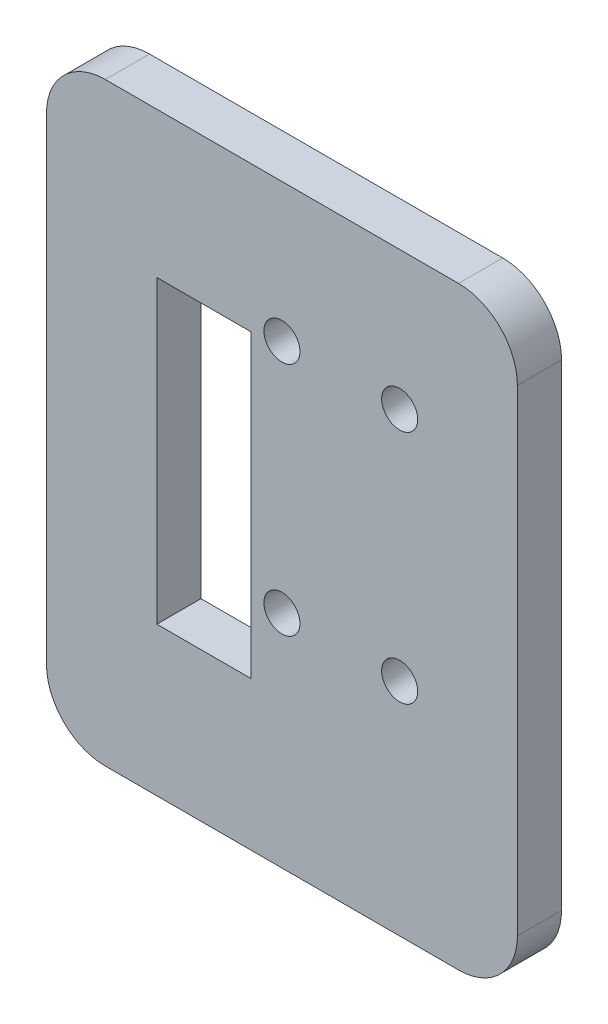
ISO-10303-21;
HEADER;
FILE_DESCRIPTION(('STEP AP214'),'2;1');
FILE_NAME('part.step','',(''),(''),'','','');
FILE_SCHEMA(('AUTOMOTIVE_DESIGN { 1 0 10303 214 1 1 1 1 }'));
ENDSEC;
DATA;
#1=APPLICATION_CONTEXT('core data for automotive mechanical design processes');
#2=APPLICATION_PROTOCOL_DEFINITION('international standard','automotive_design',2000,#1);
#3=PRODUCT_CONTEXT('',#1,'mechanical');
#4=PRODUCT('Part','Part','',(#3));
#5=PRODUCT_RELATED_PRODUCT_CATEGORY('part','',(#4));
#6=PRODUCT_DEFINITION_FORMATION('','',#4);
#7=PRODUCT_DEFINITION_CONTEXT('part definition',#1,'design');
#8=PRODUCT_DEFINITION('design','',#6,#7);
#9=PRODUCT_DEFINITION_SHAPE('','',#8);
#10=(LENGTH_UNIT() NAMED_UNIT(*) SI_UNIT(.MILLI.,.METRE.));
#11=(NAMED_UNIT(*) PLANE_ANGLE_UNIT() SI_UNIT($,.RADIAN.));
#12=(NAMED_UNIT(*) SI_UNIT($,.STERADIAN.) SOLID_ANGLE_UNIT());
#13=UNCERTAINTY_MEASURE_WITH_UNIT(LENGTH_MEASURE(1.E-05),#10,'distance_accuracy_value','');
#14=(GEOMETRIC_REPRESENTATION_CONTEXT(3) GLOBAL_UNCERTAINTY_ASSIGNED_CONTEXT((#13)) GLOBAL_UNIT_ASSIGNED_CONTEXT((#10,
#11,#12)) REPRESENTATION_CONTEXT('',''));
#15=CARTESIAN_POINT('',(0.,0.,0.));
#16=DIRECTION('',(0.,0.,1.));
#17=DIRECTION('',(1.,0.,0.));
#18=AXIS2_PLACEMENT_3D('',#15,#16,#17);
#19=CARTESIAN_POINT('',(0.,0.,3.));
#20=DIRECTION('',(0.,0.,1.));
#21=DIRECTION('',(1.,0.,0.));
#22=AXIS2_PLACEMENT_3D('',#19,#20,#21);
#23=PLANE('',#22);
#24=CARTESIAN_POINT('',(16.,31.,3.));
#25=DIRECTION('',(0.,0.,1.));
#26=DIRECTION('',(1.,0.,0.));
#27=AXIS2_PLACEMENT_3D('',#24,#25,#26);
#28=CIRCLE('',#27,1.225);
#29=CARTESIAN_POINT('',(17.225,31.,3.));
#30=VERTEX_POINT('',#29);
#31=EDGE_CURVE('E423',#30,#30,#28,.T.);
#32=ORIENTED_EDGE('',*,*,#31,.F.);
#33=EDGE_LOOP('',(#32));
#34=FACE_BOUND('',#33,.T.);
#35=CARTESIAN_POINT('',(24.,31.,3.));
#36=DIRECTION('',(0.,0.,1.));
#37=DIRECTION('',(1.,0.,0.));
#38=AXIS2_PLACEMENT_3D('',#35,#36,#37);
#39=CIRCLE('',#38,1.225);
#40=CARTESIAN_POINT('',(25.225,31.,3.));
#41=VERTEX_POINT('',#40);
#42=EDGE_CURVE('E159',#41,#41,#39,.T.);
#43=ORIENTED_EDGE('',*,*,#42,.F.);
#44=EDGE_LOOP('',(#43));
#45=FACE_BOUND('',#44,.T.);
#46=DIRECTION('',(0.,-1.,0.));
#47=VECTOR('',#46,1.);
#48=CARTESIAN_POINT('',(0.,0.,3.));
#49=LINE('',#48,#47);
#50=CARTESIAN_POINT('',(0.,36.4,3.));
#51=VERTEX_POINT('',#50);
#52=CARTESIAN_POINT('',(0.,4.,3.));
#53=VERTEX_POINT('',#52);
#54=EDGE_CURVE('E170',#51,#53,#49,.T.);
#55=ORIENTED_EDGE('',*,*,#54,.T.);
#56=CARTESIAN_POINT('',(4.,4.,3.));
#57=DIRECTION('',(0.,0.,1.));
#58=DIRECTION('',(1.,0.,0.));
#59=AXIS2_PLACEMENT_3D('',#56,#57,#58);
#60=CIRCLE('',#59,4.);
#61=CARTESIAN_POINT('',(4.,0.,3.));
#62=VERTEX_POINT('',#61);
#63=EDGE_CURVE('E213',#53,#62,#60,.T.);
#64=ORIENTED_EDGE('',*,*,#63,.T.);
#65=DIRECTION('',(1.,0.,0.));
#66=VECTOR('',#65,1.);
#67=CARTESIAN_POINT('',(0.,0.,3.));
#68=LINE('',#67,#66);
#69=CARTESIAN_POINT('',(28.,0.,3.));
#70=VERTEX_POINT('',#69);
#71=EDGE_CURVE('E173',#62,#70,#68,.T.);
#72=ORIENTED_EDGE('',*,*,#71,.T.);
#73=CARTESIAN_POINT('',(28.,4.,3.));
#74=DIRECTION('',(0.,0.,1.));
#75=DIRECTION('',(1.,0.,0.));
#76=AXIS2_PLACEMENT_3D('',#73,#74,#75);
#77=CIRCLE('',#76,4.);
#78=CARTESIAN_POINT('',(32.,4.,3.));
#79=VERTEX_POINT('',#78);
#80=EDGE_CURVE('E211',#70,#79,#77,.T.);
#81=ORIENTED_EDGE('',*,*,#80,.T.);
#82=DIRECTION('',(0.,1.,0.));
#83=VECTOR('',#82,1.);
#84=CARTESIAN_POINT('',(32.,0.,3.));
#85=LINE('',#84,#83);
#86=CARTESIAN_POINT('',(32.,36.4,3.));
#87=VERTEX_POINT('',#86);
#88=EDGE_CURVE('E177',#79,#87,#85,.T.);
#89=ORIENTED_EDGE('',*,*,#88,.T.);
#90=CARTESIAN_POINT('',(28.,36.4,3.));
#91=DIRECTION('',(0.,0.,1.));
#92=DIRECTION('',(1.,0.,0.));
#93=AXIS2_PLACEMENT_3D('',#90,#91,#92);
#94=CIRCLE('',#93,4.);
#95=CARTESIAN_POINT('',(28.,40.4,3.));
#96=VERTEX_POINT('',#95);
#97=EDGE_CURVE('E56',#87,#96,#94,.T.);
#98=ORIENTED_EDGE('',*,*,#97,.T.);
#99=DIRECTION('',(-1.,0.,0.));
#100=VECTOR('',#99,1.);
#101=CARTESIAN_POINT('',(32.,40.4,3.));
#102=LINE('',#101,#100);
#103=CARTESIAN_POINT('',(3.99999999999999,40.4,3.));
#104=VERTEX_POINT('',#103);
#105=EDGE_CURVE('E179',#96,#104,#102,.T.);
#106=ORIENTED_EDGE('',*,*,#105,.T.);
#107=CARTESIAN_POINT('',(3.99999999999999,36.4,3.));
#108=DIRECTION('',(0.,0.,1.));
#109=DIRECTION('',(1.,0.,0.));
#110=AXIS2_PLACEMENT_3D('',#107,#108,#109);
#111=CIRCLE('',#110,4.);
#112=EDGE_CURVE('E208',#104,#51,#111,.T.);
#113=ORIENTED_EDGE('',*,*,#112,.T.);
#114=EDGE_LOOP('',(#55,#64,#72,#81,#89,#98,#106,#113));
#115=FACE_BOUND('',#114,.T.);
#116=DIRECTION('',(0.,1.,0.));
#117=VECTOR('',#116,1.);
#118=CARTESIAN_POINT('',(13.9,30.5,3.));
#119=LINE('',#118,#117);
#120=CARTESIAN_POINT('',(13.9,10.1,3.));
#121=VERTEX_POINT('',#120);
#122=CARTESIAN_POINT('',(13.9,30.5,3.));
#123=VERTEX_POINT('',#122);
#124=EDGE_CURVE('E136',#121,#123,#119,.T.);
#125=ORIENTED_EDGE('',*,*,#124,.F.);
#126=DIRECTION('',(1.,0.,0.));
#127=VECTOR('',#126,1.);
#128=CARTESIAN_POINT('',(13.9,10.1,3.));
#129=LINE('',#128,#127);
#130=CARTESIAN_POINT('',(7.5,10.1,3.));
#131=VERTEX_POINT('',#130);
#132=EDGE_CURVE('E126',#131,#121,#129,.T.);
#133=ORIENTED_EDGE('',*,*,#132,.F.);
#134=DIRECTION('',(0.,-1.,0.));
#135=VECTOR('',#134,1.);
#136=CARTESIAN_POINT('',(7.5,10.1,3.));
#137=LINE('',#136,#135);
#138=CARTESIAN_POINT('',(7.5,30.5,3.));
#139=VERTEX_POINT('',#138);
#140=EDGE_CURVE('E152',#139,#131,#137,.T.);
#141=ORIENTED_EDGE('',*,*,#140,.F.);
#142=DIRECTION('',(-1.,0.,0.));
#143=VECTOR('',#142,1.);
#144=CARTESIAN_POINT('',(7.5,30.5,3.));
#145=LINE('',#144,#143);
#146=EDGE_CURVE('E150',#123,#139,#145,.T.);
#147=ORIENTED_EDGE('',*,*,#146,.F.);
#148=EDGE_LOOP('',(#125,#133,#141,#147));
#149=FACE_BOUND('',#148,.T.);
#150=CARTESIAN_POINT('',(24.,15.,3.));
#151=DIRECTION('',(0.,0.,1.));
#152=DIRECTION('',(1.,0.,0.));
#153=AXIS2_PLACEMENT_3D('',#150,#151,#152);
#154=CIRCLE('',#153,1.225);
#155=CARTESIAN_POINT('',(25.225,15.,3.));
#156=VERTEX_POINT('',#155);
#157=EDGE_CURVE('E429',#156,#156,#154,.T.);
#158=ORIENTED_EDGE('',*,*,#157,.F.);
#159=EDGE_LOOP('',(#158));
#160=FACE_BOUND('',#159,.T.);
#161=CARTESIAN_POINT('',(16.,15.,3.));
#162=DIRECTION('',(0.,0.,1.));
#163=DIRECTION('',(1.,0.,0.));
#164=AXIS2_PLACEMENT_3D('',#161,#162,#163);
#165=CIRCLE('',#164,1.225);
#166=CARTESIAN_POINT('',(17.225,15.,3.));
#167=VERTEX_POINT('',#166);
#168=EDGE_CURVE('E414',#167,#167,#165,.T.);
#169=ORIENTED_EDGE('',*,*,#168,.F.);
#170=EDGE_LOOP('',(#169));
#171=FACE_BOUND('',#170,.T.);
#172=ADVANCED_FACE('F35',(#34,#45,#115,#149,#160,#171),#23,.T.);
#173=CARTESIAN_POINT('',(0.,0.,0.));
#174=DIRECTION('',(0.,0.,1.));
#175=DIRECTION('',(1.,0.,0.));
#176=AXIS2_PLACEMENT_3D('',#173,#174,#175);
#177=PLANE('',#176);
#178=CARTESIAN_POINT('',(16.,31.,0.));
#179=DIRECTION('',(0.,0.,1.));
#180=DIRECTION('',(1.,0.,0.));
#181=AXIS2_PLACEMENT_3D('',#178,#179,#180);
#182=CIRCLE('',#181,1.225);
#183=CARTESIAN_POINT('',(17.225,31.,0.));
#184=VERTEX_POINT('',#183);
#185=EDGE_CURVE('E420',#184,#184,#182,.T.);
#186=ORIENTED_EDGE('',*,*,#185,.T.);
#187=EDGE_LOOP('',(#186));
#188=FACE_BOUND('',#187,.T.);
#189=CARTESIAN_POINT('',(24.,31.,0.));
#190=DIRECTION('',(0.,0.,1.));
#191=DIRECTION('',(1.,0.,0.));
#192=AXIS2_PLACEMENT_3D('',#189,#190,#191);
#193=CIRCLE('',#192,1.225);
#194=CARTESIAN_POINT('',(25.225,31.,0.));
#195=VERTEX_POINT('',#194);
#196=EDGE_CURVE('E432',#195,#195,#193,.T.);
#197=ORIENTED_EDGE('',*,*,#196,.T.);
#198=EDGE_LOOP('',(#197));
#199=FACE_BOUND('',#198,.T.);
#200=DIRECTION('',(1.,0.,0.));
#201=VECTOR('',#200,1.);
#202=CARTESIAN_POINT('',(0.,0.,0.));
#203=LINE('',#202,#201);
#204=CARTESIAN_POINT('',(4.,0.,0.));
#205=VERTEX_POINT('',#204);
#206=CARTESIAN_POINT('',(28.,0.,0.));
#207=VERTEX_POINT('',#206);
#208=EDGE_CURVE('E184',#205,#207,#203,.T.);
#209=ORIENTED_EDGE('',*,*,#208,.F.);
#210=CARTESIAN_POINT('',(4.,4.,0.));
#211=DIRECTION('',(0.,0.,1.));
#212=DIRECTION('',(1.,0.,0.));
#213=AXIS2_PLACEMENT_3D('',#210,#211,#212);
#214=CIRCLE('',#213,4.);
#215=CARTESIAN_POINT('',(0.,4.,0.));
#216=VERTEX_POINT('',#215);
#217=EDGE_CURVE('E201',#205,#216,#214,.F.);
#218=ORIENTED_EDGE('',*,*,#217,.T.);
#219=DIRECTION('',(0.,-1.,0.));
#220=VECTOR('',#219,1.);
#221=CARTESIAN_POINT('',(0.,0.,0.));
#222=LINE('',#221,#220);
#223=CARTESIAN_POINT('',(0.,36.4,0.));
#224=VERTEX_POINT('',#223);
#225=EDGE_CURVE('E144',#224,#216,#222,.T.);
#226=ORIENTED_EDGE('',*,*,#225,.F.);
#227=CARTESIAN_POINT('',(3.99999999999999,36.4,0.));
#228=DIRECTION('',(0.,0.,1.));
#229=DIRECTION('',(1.,0.,0.));
#230=AXIS2_PLACEMENT_3D('',#227,#228,#229);
#231=CIRCLE('',#230,4.);
#232=CARTESIAN_POINT('',(3.99999999999999,40.4,0.));
#233=VERTEX_POINT('',#232);
#234=EDGE_CURVE('E195',#224,#233,#231,.F.);
#235=ORIENTED_EDGE('',*,*,#234,.T.);
#236=DIRECTION('',(-1.,0.,0.));
#237=VECTOR('',#236,1.);
#238=CARTESIAN_POINT('',(32.,40.4,0.));
#239=LINE('',#238,#237);
#240=CARTESIAN_POINT('',(28.,40.4,0.));
#241=VERTEX_POINT('',#240);
#242=EDGE_CURVE('E174',#241,#233,#239,.T.);
#243=ORIENTED_EDGE('',*,*,#242,.F.);
#244=CARTESIAN_POINT('',(28.,36.4,0.));
#245=DIRECTION('',(0.,0.,1.));
#246=DIRECTION('',(1.,0.,0.));
#247=AXIS2_PLACEMENT_3D('',#244,#245,#246);
#248=CIRCLE('',#247,4.);
#249=CARTESIAN_POINT('',(32.,36.4,0.));
#250=VERTEX_POINT('',#249);
#251=EDGE_CURVE('E197',#241,#250,#248,.F.);
#252=ORIENTED_EDGE('',*,*,#251,.T.);
#253=DIRECTION('',(0.,1.,0.));
#254=VECTOR('',#253,1.);
#255=CARTESIAN_POINT('',(32.,0.,0.));
#256=LINE('',#255,#254);
#257=CARTESIAN_POINT('',(32.,4.,0.));
#258=VERTEX_POINT('',#257);
#259=EDGE_CURVE('E187',#258,#250,#256,.T.);
#260=ORIENTED_EDGE('',*,*,#259,.F.);
#261=CARTESIAN_POINT('',(28.,4.,0.));
#262=DIRECTION('',(0.,0.,1.));
#263=DIRECTION('',(1.,0.,0.));
#264=AXIS2_PLACEMENT_3D('',#261,#262,#263);
#265=CIRCLE('',#264,4.);
#266=EDGE_CURVE('E199',#258,#207,#265,.F.);
#267=ORIENTED_EDGE('',*,*,#266,.T.);
#268=EDGE_LOOP('',(#209,#218,#226,#235,#243,#252,#260,#267));
#269=FACE_BOUND('',#268,.T.);
#270=DIRECTION('',(1.,0.,0.));
#271=VECTOR('',#270,1.);
#272=CARTESIAN_POINT('',(13.9,10.1,0.));
#273=LINE('',#272,#271);
#274=CARTESIAN_POINT('',(7.5,10.1,0.));
#275=VERTEX_POINT('',#274);
#276=CARTESIAN_POINT('',(13.9,10.1,0.));
#277=VERTEX_POINT('',#276);
#278=EDGE_CURVE('E157',#275,#277,#273,.T.);
#279=ORIENTED_EDGE('',*,*,#278,.T.);
#280=DIRECTION('',(0.,1.,0.));
#281=VECTOR('',#280,1.);
#282=CARTESIAN_POINT('',(13.9,30.5,0.));
#283=LINE('',#282,#281);
#284=CARTESIAN_POINT('',(13.9,30.5,0.));
#285=VERTEX_POINT('',#284);
#286=EDGE_CURVE('E143',#277,#285,#283,.T.);
#287=ORIENTED_EDGE('',*,*,#286,.T.);
#288=DIRECTION('',(-1.,0.,0.));
#289=VECTOR('',#288,1.);
#290=CARTESIAN_POINT('',(7.5,30.5,0.));
#291=LINE('',#290,#289);
#292=CARTESIAN_POINT('',(7.5,30.5,0.));
#293=VERTEX_POINT('',#292);
#294=EDGE_CURVE('E161',#285,#293,#291,.T.);
#295=ORIENTED_EDGE('',*,*,#294,.T.);
#296=DIRECTION('',(0.,-1.,0.));
#297=VECTOR('',#296,1.);
#298=CARTESIAN_POINT('',(7.5,10.1,0.));
#299=LINE('',#298,#297);
#300=EDGE_CURVE('E137',#293,#275,#299,.T.);
#301=ORIENTED_EDGE('',*,*,#300,.T.);
#302=EDGE_LOOP('',(#279,#287,#295,#301));
#303=FACE_BOUND('',#302,.T.);
#304=CARTESIAN_POINT('',(24.,15.,0.));
#305=DIRECTION('',(0.,0.,1.));
#306=DIRECTION('',(1.,0.,0.));
#307=AXIS2_PLACEMENT_3D('',#304,#305,#306);
#308=CIRCLE('',#307,1.225);
#309=CARTESIAN_POINT('',(25.225,15.,0.));
#310=VERTEX_POINT('',#309);
#311=EDGE_CURVE('E426',#310,#310,#308,.T.);
#312=ORIENTED_EDGE('',*,*,#311,.T.);
#313=EDGE_LOOP('',(#312));
#314=FACE_BOUND('',#313,.T.);
#315=CARTESIAN_POINT('',(16.,15.,0.));
#316=DIRECTION('',(0.,0.,1.));
#317=DIRECTION('',(1.,0.,0.));
#318=AXIS2_PLACEMENT_3D('',#315,#316,#317);
#319=CIRCLE('',#318,1.225);
#320=CARTESIAN_POINT('',(17.225,15.,0.));
#321=VERTEX_POINT('',#320);
#322=EDGE_CURVE('E417',#321,#321,#319,.T.);
#323=ORIENTED_EDGE('',*,*,#322,.T.);
#324=EDGE_LOOP('',(#323));
#325=FACE_BOUND('',#324,.T.);
#326=ADVANCED_FACE('F229',(#188,#199,#269,#303,#314,#325),#177,.F.);
#327=CARTESIAN_POINT('',(0.,0.,3.));
#328=DIRECTION('',(1.,0.,0.));
#329=DIRECTION('',(0.,1.,0.));
#330=AXIS2_PLACEMENT_3D('',#327,#328,#329);
#331=PLANE('',#330);
#332=ORIENTED_EDGE('',*,*,#225,.T.);
#333=DIRECTION('',(0.,0.,-1.));
#334=VECTOR('',#333,1.);
#335=CARTESIAN_POINT('',(0.,4.,3.));
#336=LINE('',#335,#334);
#337=EDGE_CURVE('E206',#216,#53,#336,.F.);
#338=ORIENTED_EDGE('',*,*,#337,.T.);
#339=ORIENTED_EDGE('',*,*,#54,.F.);
#340=DIRECTION('',(0.,0.,-1.));
#341=VECTOR('',#340,1.);
#342=CARTESIAN_POINT('',(0.,36.4,3.));
#343=LINE('',#342,#341);
#344=EDGE_CURVE('E203',#51,#224,#343,.T.);
#345=ORIENTED_EDGE('',*,*,#344,.T.);
#346=EDGE_LOOP('',(#332,#338,#339,#345));
#347=FACE_BOUND('',#346,.T.);
#348=ADVANCED_FACE('F242',(#347),#331,.F.);
#349=CARTESIAN_POINT('',(0.,0.,3.));
#350=DIRECTION('',(0.,1.,0.));
#351=DIRECTION('',(0.,0.,1.));
#352=AXIS2_PLACEMENT_3D('',#349,#350,#351);
#353=PLANE('',#352);
#354=ORIENTED_EDGE('',*,*,#71,.F.);
#355=DIRECTION('',(0.,0.,-1.));
#356=VECTOR('',#355,1.);
#357=CARTESIAN_POINT('',(4.,0.,3.));
#358=LINE('',#357,#356);
#359=EDGE_CURVE('E192',#62,#205,#358,.T.);
#360=ORIENTED_EDGE('',*,*,#359,.T.);
#361=ORIENTED_EDGE('',*,*,#208,.T.);
#362=DIRECTION('',(0.,0.,-1.));
#363=VECTOR('',#362,1.);
#364=CARTESIAN_POINT('',(28.,0.,3.));
#365=LINE('',#364,#363);
#366=EDGE_CURVE('E181',#207,#70,#365,.F.);
#367=ORIENTED_EDGE('',*,*,#366,.T.);
#368=EDGE_LOOP('',(#354,#360,#361,#367));
#369=FACE_BOUND('',#368,.T.);
#370=ADVANCED_FACE('F250',(#369),#353,.F.);
#371=CARTESIAN_POINT('',(32.,0.,3.));
#372=DIRECTION('',(-1.,0.,0.));
#373=DIRECTION('',(0.,-1.,0.));
#374=AXIS2_PLACEMENT_3D('',#371,#372,#373);
#375=PLANE('',#374);
#376=ORIENTED_EDGE('',*,*,#88,.F.);
#377=DIRECTION('',(0.,0.,-1.));
#378=VECTOR('',#377,1.);
#379=CARTESIAN_POINT('',(32.,4.,3.));
#380=LINE('',#379,#378);
#381=EDGE_CURVE('E217',#79,#258,#380,.T.);
#382=ORIENTED_EDGE('',*,*,#381,.T.);
#383=ORIENTED_EDGE('',*,*,#259,.T.);
#384=DIRECTION('',(0.,0.,-1.));
#385=VECTOR('',#384,1.);
#386=CARTESIAN_POINT('',(32.,36.4,3.));
#387=LINE('',#386,#385);
#388=EDGE_CURVE('E215',#250,#87,#387,.F.);
#389=ORIENTED_EDGE('',*,*,#388,.T.);
#390=EDGE_LOOP('',(#376,#382,#383,#389));
#391=FACE_BOUND('',#390,.T.);
#392=ADVANCED_FACE('F223',(#391),#375,.F.);
#393=CARTESIAN_POINT('',(32.,40.4,3.));
#394=DIRECTION('',(0.,-1.,0.));
#395=DIRECTION('',(0.,0.,-1.));
#396=AXIS2_PLACEMENT_3D('',#393,#394,#395);
#397=PLANE('',#396);
#398=ORIENTED_EDGE('',*,*,#105,.F.);
#399=DIRECTION('',(0.,0.,-1.));
#400=VECTOR('',#399,1.);
#401=CARTESIAN_POINT('',(28.,40.4,3.));
#402=LINE('',#401,#400);
#403=EDGE_CURVE('E11',#96,#241,#402,.T.);
#404=ORIENTED_EDGE('',*,*,#403,.T.);
#405=ORIENTED_EDGE('',*,*,#242,.T.);
#406=DIRECTION('',(0.,0.,-1.));
#407=VECTOR('',#406,1.);
#408=CARTESIAN_POINT('',(3.99999999999999,40.4,3.));
#409=LINE('',#408,#407);
#410=EDGE_CURVE('E43',#233,#104,#409,.F.);
#411=ORIENTED_EDGE('',*,*,#410,.T.);
#412=EDGE_LOOP('',(#398,#404,#405,#411));
#413=FACE_BOUND('',#412,.T.);
#414=ADVANCED_FACE('F235',(#413),#397,.F.);
#415=CARTESIAN_POINT('',(13.9,10.1,3.));
#416=DIRECTION('',(0.,1.,0.));
#417=DIRECTION('',(0.,0.,1.));
#418=AXIS2_PLACEMENT_3D('',#415,#416,#417);
#419=PLANE('',#418);
#420=ORIENTED_EDGE('',*,*,#278,.F.);
#421=DIRECTION('',(0.,0.,-1.));
#422=VECTOR('',#421,1.);
#423=CARTESIAN_POINT('',(7.5,10.1,3.));
#424=LINE('',#423,#422);
#425=EDGE_CURVE('E132',#131,#275,#424,.T.);
#426=ORIENTED_EDGE('',*,*,#425,.F.);
#427=ORIENTED_EDGE('',*,*,#132,.T.);
#428=DIRECTION('',(0.,0.,-1.));
#429=VECTOR('',#428,1.);
#430=CARTESIAN_POINT('',(13.9,10.1,3.));
#431=LINE('',#430,#429);
#432=EDGE_CURVE('E129',#121,#277,#431,.T.);
#433=ORIENTED_EDGE('',*,*,#432,.T.);
#434=EDGE_LOOP('',(#420,#426,#427,#433));
#435=FACE_BOUND('',#434,.T.);
#436=ADVANCED_FACE('F128',(#435),#419,.T.);
#437=CARTESIAN_POINT('',(13.9,30.5,3.));
#438=DIRECTION('',(-1.,0.,0.));
#439=DIRECTION('',(0.,0.,1.));
#440=AXIS2_PLACEMENT_3D('',#437,#438,#439);
#441=PLANE('',#440);
#442=ORIENTED_EDGE('',*,*,#286,.F.);
#443=ORIENTED_EDGE('',*,*,#432,.F.);
#444=ORIENTED_EDGE('',*,*,#124,.T.);
#445=DIRECTION('',(0.,0.,-1.));
#446=VECTOR('',#445,1.);
#447=CARTESIAN_POINT('',(13.9,30.5,3.));
#448=LINE('',#447,#446);
#449=EDGE_CURVE('E145',#123,#285,#448,.T.);
#450=ORIENTED_EDGE('',*,*,#449,.T.);
#451=EDGE_LOOP('',(#442,#443,#444,#450));
#452=FACE_BOUND('',#451,.T.);
#453=ADVANCED_FACE('F140',(#452),#441,.T.);
#454=CARTESIAN_POINT('',(7.5,30.5,3.));
#455=DIRECTION('',(0.,-1.,0.));
#456=DIRECTION('',(0.,0.,-1.));
#457=AXIS2_PLACEMENT_3D('',#454,#455,#456);
#458=PLANE('',#457);
#459=ORIENTED_EDGE('',*,*,#294,.F.);
#460=ORIENTED_EDGE('',*,*,#449,.F.);
#461=ORIENTED_EDGE('',*,*,#146,.T.);
#462=DIRECTION('',(0.,0.,-1.));
#463=VECTOR('',#462,1.);
#464=CARTESIAN_POINT('',(7.5,30.5,3.));
#465=LINE('',#464,#463);
#466=EDGE_CURVE('E167',#139,#293,#465,.T.);
#467=ORIENTED_EDGE('',*,*,#466,.T.);
#468=EDGE_LOOP('',(#459,#460,#461,#467));
#469=FACE_BOUND('',#468,.T.);
#470=ADVANCED_FACE('F309',(#469),#458,.T.);
#471=CARTESIAN_POINT('',(7.5,10.1,3.));
#472=DIRECTION('',(1.,0.,0.));
#473=DIRECTION('',(0.,0.,-1.));
#474=AXIS2_PLACEMENT_3D('',#471,#472,#473);
#475=PLANE('',#474);
#476=ORIENTED_EDGE('',*,*,#300,.F.);
#477=ORIENTED_EDGE('',*,*,#466,.F.);
#478=ORIENTED_EDGE('',*,*,#140,.T.);
#479=ORIENTED_EDGE('',*,*,#425,.T.);
#480=EDGE_LOOP('',(#476,#477,#478,#479));
#481=FACE_BOUND('',#480,.T.);
#482=ADVANCED_FACE('F315',(#481),#475,.T.);
#483=CARTESIAN_POINT('',(24.,31.,3.));
#484=DIRECTION('',(0.,0.,-1.));
#485=DIRECTION('',(-1.,0.,0.));
#486=AXIS2_PLACEMENT_3D('',#483,#484,#485);
#487=CYLINDRICAL_SURFACE('',#486,1.225);
#488=ORIENTED_EDGE('',*,*,#42,.T.);
#489=EDGE_LOOP('',(#488));
#490=FACE_BOUND('',#489,.T.);
#491=ORIENTED_EDGE('',*,*,#196,.F.);
#492=EDGE_LOOP('',(#491));
#493=FACE_BOUND('',#492,.T.);
#494=ADVANCED_FACE('F323',(#490,#493),#487,.F.);
#495=CARTESIAN_POINT('',(24.,15.,3.));
#496=DIRECTION('',(0.,0.,-1.));
#497=DIRECTION('',(-1.,0.,0.));
#498=AXIS2_PLACEMENT_3D('',#495,#496,#497);
#499=CYLINDRICAL_SURFACE('',#498,1.225);
#500=ORIENTED_EDGE('',*,*,#157,.T.);
#501=EDGE_LOOP('',(#500));
#502=FACE_BOUND('',#501,.T.);
#503=ORIENTED_EDGE('',*,*,#311,.F.);
#504=EDGE_LOOP('',(#503));
#505=FACE_BOUND('',#504,.T.);
#506=ADVANCED_FACE('F331',(#502,#505),#499,.F.);
#507=CARTESIAN_POINT('',(16.,31.,3.));
#508=DIRECTION('',(0.,0.,-1.));
#509=DIRECTION('',(-1.,0.,0.));
#510=AXIS2_PLACEMENT_3D('',#507,#508,#509);
#511=CYLINDRICAL_SURFACE('',#510,1.225);
#512=ORIENTED_EDGE('',*,*,#31,.T.);
#513=EDGE_LOOP('',(#512));
#514=FACE_BOUND('',#513,.T.);
#515=ORIENTED_EDGE('',*,*,#185,.F.);
#516=EDGE_LOOP('',(#515));
#517=FACE_BOUND('',#516,.T.);
#518=ADVANCED_FACE('F339',(#514,#517),#511,.F.);
#519=CARTESIAN_POINT('',(16.,15.,3.));
#520=DIRECTION('',(0.,0.,-1.));
#521=DIRECTION('',(-1.,0.,0.));
#522=AXIS2_PLACEMENT_3D('',#519,#520,#521);
#523=CYLINDRICAL_SURFACE('',#522,1.225);
#524=ORIENTED_EDGE('',*,*,#168,.T.);
#525=EDGE_LOOP('',(#524));
#526=FACE_BOUND('',#525,.T.);
#527=ORIENTED_EDGE('',*,*,#322,.F.);
#528=EDGE_LOOP('',(#527));
#529=FACE_BOUND('',#528,.T.);
#530=ADVANCED_FACE('F259',(#526,#529),#523,.F.);
#531=CARTESIAN_POINT('',(4.,4.,3.));
#532=DIRECTION('',(0.,0.,-1.));
#533=DIRECTION('',(-1.,0.,0.));
#534=AXIS2_PLACEMENT_3D('',#531,#532,#533);
#535=CYLINDRICAL_SURFACE('',#534,4.);
#536=ORIENTED_EDGE('',*,*,#63,.F.);
#537=ORIENTED_EDGE('',*,*,#337,.F.);
#538=ORIENTED_EDGE('',*,*,#217,.F.);
#539=ORIENTED_EDGE('',*,*,#359,.F.);
#540=EDGE_LOOP('',(#536,#537,#538,#539));
#541=FACE_BOUND('',#540,.T.);
#542=ADVANCED_FACE('F247',(#541),#535,.T.);
#543=CARTESIAN_POINT('',(28.,4.,3.));
#544=DIRECTION('',(0.,0.,-1.));
#545=DIRECTION('',(-1.,0.,0.));
#546=AXIS2_PLACEMENT_3D('',#543,#544,#545);
#547=CYLINDRICAL_SURFACE('',#546,4.);
#548=ORIENTED_EDGE('',*,*,#80,.F.);
#549=ORIENTED_EDGE('',*,*,#366,.F.);
#550=ORIENTED_EDGE('',*,*,#266,.F.);
#551=ORIENTED_EDGE('',*,*,#381,.F.);
#552=EDGE_LOOP('',(#548,#549,#550,#551));
#553=FACE_BOUND('',#552,.T.);
#554=ADVANCED_FACE('F252',(#553),#547,.T.);
#555=CARTESIAN_POINT('',(28.,36.4,3.));
#556=DIRECTION('',(0.,0.,-1.));
#557=DIRECTION('',(-1.,0.,0.));
#558=AXIS2_PLACEMENT_3D('',#555,#556,#557);
#559=CYLINDRICAL_SURFACE('',#558,4.);
#560=ORIENTED_EDGE('',*,*,#97,.F.);
#561=ORIENTED_EDGE('',*,*,#388,.F.);
#562=ORIENTED_EDGE('',*,*,#251,.F.);
#563=ORIENTED_EDGE('',*,*,#403,.F.);
#564=EDGE_LOOP('',(#560,#561,#562,#563));
#565=FACE_BOUND('',#564,.T.);
#566=ADVANCED_FACE('F234',(#565),#559,.T.);
#567=CARTESIAN_POINT('',(3.99999999999999,36.4,3.));
#568=DIRECTION('',(0.,0.,-1.));
#569=DIRECTION('',(-1.,0.,0.));
#570=AXIS2_PLACEMENT_3D('',#567,#568,#569);
#571=CYLINDRICAL_SURFACE('',#570,4.);
#572=ORIENTED_EDGE('',*,*,#112,.F.);
#573=ORIENTED_EDGE('',*,*,#410,.F.);
#574=ORIENTED_EDGE('',*,*,#234,.F.);
#575=ORIENTED_EDGE('',*,*,#344,.F.);
#576=EDGE_LOOP('',(#572,#573,#574,#575));
#577=FACE_BOUND('',#576,.T.);
#578=ADVANCED_FACE('F37',(#577),#571,.T.);
#579=CLOSED_SHELL('',(#172,#326,#348,#370,#392,#414,#436,#453,#470,#482,#494,#506,#518,#530,
#542,#554,#566,#578));
#580=MANIFOLD_SOLID_BREP('B2',#579);
#581=ADVANCED_BREP_SHAPE_REPRESENTATION('',(#18,#580),#14);
#582=SHAPE_DEFINITION_REPRESENTATION(#9,#581);
ENDSEC;
END-ISO-10303-21;
